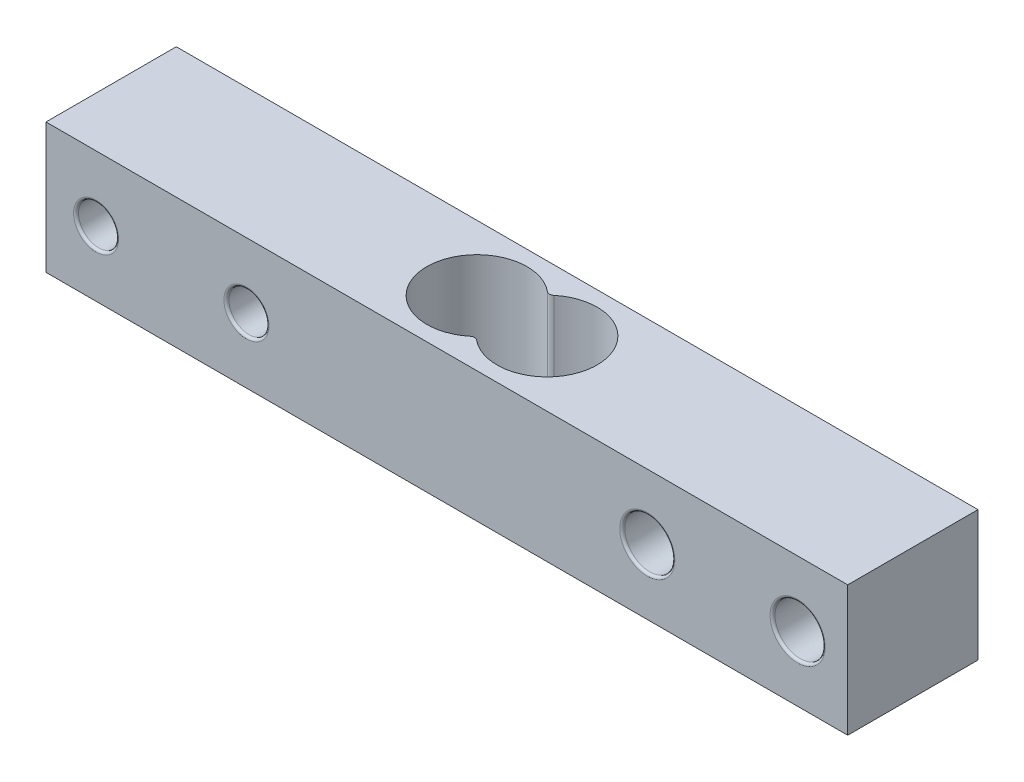
ISO-10303-21;
HEADER;
FILE_DESCRIPTION(('STEP AP214'),'2;1');
FILE_NAME('part.step','',(''),(''),'','','');
FILE_SCHEMA(('AUTOMOTIVE_DESIGN { 1 0 10303 214 1 1 1 1 }'));
ENDSEC;
DATA;
#1=APPLICATION_CONTEXT('core data for automotive mechanical design processes');
#2=APPLICATION_PROTOCOL_DEFINITION('international standard','automotive_design',2000,#1);
#3=PRODUCT_CONTEXT('',#1,'mechanical');
#4=PRODUCT('Part','Part','',(#3));
#5=PRODUCT_RELATED_PRODUCT_CATEGORY('part','',(#4));
#6=PRODUCT_DEFINITION_FORMATION('','',#4);
#7=PRODUCT_DEFINITION_CONTEXT('part definition',#1,'design');
#8=PRODUCT_DEFINITION('design','',#6,#7);
#9=PRODUCT_DEFINITION_SHAPE('','',#8);
#10=(LENGTH_UNIT() NAMED_UNIT(*) SI_UNIT(.MILLI.,.METRE.));
#11=(NAMED_UNIT(*) PLANE_ANGLE_UNIT() SI_UNIT($,.RADIAN.));
#12=(NAMED_UNIT(*) SI_UNIT($,.STERADIAN.) SOLID_ANGLE_UNIT());
#13=UNCERTAINTY_MEASURE_WITH_UNIT(LENGTH_MEASURE(1.E-05),#10,'distance_accuracy_value','');
#14=(GEOMETRIC_REPRESENTATION_CONTEXT(3) GLOBAL_UNCERTAINTY_ASSIGNED_CONTEXT((#13)) GLOBAL_UNIT_ASSIGNED_CONTEXT((#10,
#11,#12)) REPRESENTATION_CONTEXT('',''));
#15=CARTESIAN_POINT('',(0.,0.,0.));
#16=DIRECTION('',(0.,0.,1.));
#17=DIRECTION('',(1.,0.,0.));
#18=AXIS2_PLACEMENT_3D('',#15,#16,#17);
#19=CARTESIAN_POINT('',(12.0209096982276,0.,-7.05386009058646));
#20=DIRECTION('',(0.,1.,0.));
#21=DIRECTION('',(1.,0.,0.));
#22=AXIS2_PLACEMENT_3D('',#19,#20,#21);
#23=PLANE('',#22);
#24=CARTESIAN_POINT('',(12.0209096982276,0.,-11.2965007777057));
#25=DIRECTION('',(0.,1.,0.));
#26=DIRECTION('',(0.,0.,1.));
#27=AXIS2_PLACEMENT_3D('',#24,#25,#26);
#28=CIRCLE('',#27,0.5);
#29=CARTESIAN_POINT('',(11.7027278800458,0.,-10.9108061697858));
#30=VERTEX_POINT('',#29);
#31=CARTESIAN_POINT('',(12.3390915164094,0.,-10.9108061697858));
#32=VERTEX_POINT('',#31);
#33=EDGE_CURVE('E264',#30,#32,#28,.T.);
#34=ORIENTED_EDGE('',*,*,#33,.F.);
#35=CARTESIAN_POINT('',(8.52090969822762,0.,-7.05386009058646));
#36=DIRECTION('',(0.,1.,0.));
#37=DIRECTION('',(-1.,0.,0.));
#38=AXIS2_PLACEMENT_3D('',#35,#36,#37);
#39=CIRCLE('',#38,5.);
#40=CARTESIAN_POINT('',(11.7027278800458,0.,-3.19691401138712));
#41=VERTEX_POINT('',#40);
#42=EDGE_CURVE('E280',#30,#41,#39,.T.);
#43=ORIENTED_EDGE('',*,*,#42,.T.);
#44=CARTESIAN_POINT('',(12.0209096982276,0.,-2.81121940346718));
#45=DIRECTION('',(0.,1.,0.));
#46=DIRECTION('',(0.,0.,-1.));
#47=AXIS2_PLACEMENT_3D('',#44,#45,#46);
#48=CIRCLE('',#47,0.5);
#49=CARTESIAN_POINT('',(12.3390915164094,0.,-3.19691401138712));
#50=VERTEX_POINT('',#49);
#51=EDGE_CURVE('E255',#50,#41,#48,.T.);
#52=ORIENTED_EDGE('',*,*,#51,.F.);
#53=CARTESIAN_POINT('',(15.5209096982276,0.,-7.05386009058646));
#54=DIRECTION('',(0.,1.,0.));
#55=DIRECTION('',(-1.,0.,0.));
#56=AXIS2_PLACEMENT_3D('',#53,#54,#55);
#57=CIRCLE('',#56,5.);
#58=EDGE_CURVE('E155',#50,#32,#57,.T.);
#59=ORIENTED_EDGE('',*,*,#58,.T.);
#60=EDGE_LOOP('',(#34,#43,#52,#59));
#61=FACE_BOUND('',#60,.T.);
#62=DIRECTION('',(-1.,0.,0.));
#63=VECTOR('',#62,1.);
#64=CARTESIAN_POINT('',(52.0209096982276,0.,-0.553860090586464));
#65=LINE('',#64,#63);
#66=CARTESIAN_POINT('',(52.0209096982276,0.,-0.553860090586464));
#67=VERTEX_POINT('',#66);
#68=CARTESIAN_POINT('',(-27.9790903017724,0.,-0.553860090586464));
#69=VERTEX_POINT('',#68);
#70=EDGE_CURVE('E266',#67,#69,#65,.T.);
#71=ORIENTED_EDGE('',*,*,#70,.T.);
#72=DIRECTION('',(0.,0.,-1.));
#73=VECTOR('',#72,1.);
#74=CARTESIAN_POINT('',(-27.9790903017724,0.,-0.553860090586464));
#75=LINE('',#74,#73);
#76=CARTESIAN_POINT('',(-27.9790903017724,0.,-13.5538600905865));
#77=VERTEX_POINT('',#76);
#78=EDGE_CURVE('E27',#69,#77,#75,.T.);
#79=ORIENTED_EDGE('',*,*,#78,.T.);
#80=DIRECTION('',(1.,0.,0.));
#81=VECTOR('',#80,1.);
#82=CARTESIAN_POINT('',(-27.9790903017724,0.,-13.5538600905865));
#83=LINE('',#82,#81);
#84=CARTESIAN_POINT('',(52.0209096982276,0.,-13.5538600905865));
#85=VERTEX_POINT('',#84);
#86=EDGE_CURVE('E259',#77,#85,#83,.T.);
#87=ORIENTED_EDGE('',*,*,#86,.T.);
#88=DIRECTION('',(0.,0.,1.));
#89=VECTOR('',#88,1.);
#90=CARTESIAN_POINT('',(52.0209096982276,0.,-13.5538600905865));
#91=LINE('',#90,#89);
#92=EDGE_CURVE('E10',#85,#67,#91,.T.);
#93=ORIENTED_EDGE('',*,*,#92,.T.);
#94=EDGE_LOOP('',(#71,#79,#87,#93));
#95=FACE_BOUND('',#94,.T.);
#96=ADVANCED_FACE('F16',(#61,#95),#23,.F.);
#97=CARTESIAN_POINT('',(52.0209096982276,0.,-0.553860090586464));
#98=DIRECTION('',(1.,0.,0.));
#99=DIRECTION('',(0.,1.,0.));
#100=AXIS2_PLACEMENT_3D('',#97,#98,#99);
#101=PLANE('',#100);
#102=ORIENTED_EDGE('',*,*,#92,.F.);
#103=DIRECTION('',(0.,1.,0.));
#104=VECTOR('',#103,1.);
#105=CARTESIAN_POINT('',(52.0209096982276,0.,-13.5538600905865));
#106=LINE('',#105,#104);
#107=CARTESIAN_POINT('',(52.0209096982276,13.,-13.5538600905865));
#108=VERTEX_POINT('',#107);
#109=EDGE_CURVE('E297',#85,#108,#106,.T.);
#110=ORIENTED_EDGE('',*,*,#109,.T.);
#111=DIRECTION('',(0.,0.,-1.));
#112=VECTOR('',#111,1.);
#113=CARTESIAN_POINT('',(52.0209096982276,13.,-13.5538600905865));
#114=LINE('',#113,#112);
#115=CARTESIAN_POINT('',(52.0209096982276,13.,-0.553860090586464));
#116=VERTEX_POINT('',#115);
#117=EDGE_CURVE('E279',#116,#108,#114,.T.);
#118=ORIENTED_EDGE('',*,*,#117,.F.);
#119=DIRECTION('',(0.,1.,0.));
#120=VECTOR('',#119,1.);
#121=CARTESIAN_POINT('',(52.0209096982276,0.,-0.553860090586464));
#122=LINE('',#121,#120);
#123=EDGE_CURVE('E250',#67,#116,#122,.T.);
#124=ORIENTED_EDGE('',*,*,#123,.F.);
#125=EDGE_LOOP('',(#102,#110,#118,#124));
#126=FACE_BOUND('',#125,.T.);
#127=ADVANCED_FACE('F363',(#126),#101,.T.);
#128=CARTESIAN_POINT('',(-27.9790903017724,0.,-13.5538600905865));
#129=DIRECTION('',(-1.,0.,0.));
#130=DIRECTION('',(0.,0.,1.));
#131=AXIS2_PLACEMENT_3D('',#128,#129,#130);
#132=PLANE('',#131);
#133=ORIENTED_EDGE('',*,*,#78,.F.);
#134=DIRECTION('',(0.,1.,0.));
#135=VECTOR('',#134,1.);
#136=CARTESIAN_POINT('',(-27.9790903017724,0.,-0.553860090586464));
#137=LINE('',#136,#135);
#138=CARTESIAN_POINT('',(-27.9790903017724,13.,-0.553860090586464));
#139=VERTEX_POINT('',#138);
#140=EDGE_CURVE('E247',#69,#139,#137,.T.);
#141=ORIENTED_EDGE('',*,*,#140,.T.);
#142=DIRECTION('',(0.,0.,1.));
#143=VECTOR('',#142,1.);
#144=CARTESIAN_POINT('',(-27.9790903017724,13.,-0.553860090586464));
#145=LINE('',#144,#143);
#146=CARTESIAN_POINT('',(-27.9790903017724,13.,-13.5538600905865));
#147=VERTEX_POINT('',#146);
#148=EDGE_CURVE('E246',#147,#139,#145,.T.);
#149=ORIENTED_EDGE('',*,*,#148,.F.);
#150=DIRECTION('',(0.,1.,0.));
#151=VECTOR('',#150,1.);
#152=CARTESIAN_POINT('',(-27.9790903017724,0.,-13.5538600905865));
#153=LINE('',#152,#151);
#154=EDGE_CURVE('E295',#77,#147,#153,.T.);
#155=ORIENTED_EDGE('',*,*,#154,.F.);
#156=EDGE_LOOP('',(#133,#141,#149,#155));
#157=FACE_BOUND('',#156,.T.);
#158=ADVANCED_FACE('F451',(#157),#132,.T.);
#159=CARTESIAN_POINT('',(15.5209096982276,13.,-7.05386009058646));
#160=DIRECTION('',(0.,-1.,0.));
#161=DIRECTION('',(1.,0.,0.));
#162=AXIS2_PLACEMENT_3D('',#159,#160,#161);
#163=CYLINDRICAL_SURFACE('',#162,5.);
#164=DIRECTION('',(0.,1.,0.));
#165=VECTOR('',#164,1.);
#166=CARTESIAN_POINT('',(12.3390915164094,13.,-10.9108061697858));
#167=LINE('',#166,#165);
#168=CARTESIAN_POINT('',(12.3390915164094,13.,-10.9108061697858));
#169=VERTEX_POINT('',#168);
#170=EDGE_CURVE('E260',#32,#169,#167,.T.);
#171=ORIENTED_EDGE('',*,*,#170,.F.);
#172=ORIENTED_EDGE('',*,*,#58,.F.);
#173=DIRECTION('',(0.,-1.,0.));
#174=VECTOR('',#173,1.);
#175=CARTESIAN_POINT('',(12.3390915164094,13.,-3.19691401138711));
#176=LINE('',#175,#174);
#177=CARTESIAN_POINT('',(12.3390915164094,13.,-3.19691401138712));
#178=VERTEX_POINT('',#177);
#179=EDGE_CURVE('E251',#178,#50,#176,.T.);
#180=ORIENTED_EDGE('',*,*,#179,.F.);
#181=CARTESIAN_POINT('',(15.5209096982276,13.,-7.05386009058646));
#182=DIRECTION('',(0.,-1.,0.));
#183=DIRECTION('',(-1.,0.,0.));
#184=AXIS2_PLACEMENT_3D('',#181,#182,#183);
#185=CIRCLE('',#184,5.);
#186=EDGE_CURVE('E241',#169,#178,#185,.T.);
#187=ORIENTED_EDGE('',*,*,#186,.F.);
#188=EDGE_LOOP('',(#171,#172,#180,#187));
#189=FACE_BOUND('',#188,.T.);
#190=ADVANCED_FACE('F471',(#189),#163,.F.);
#191=CARTESIAN_POINT('',(47.0209096982276,6.5,-0.803860090586464));
#192=DIRECTION('',(0.,0.,-1.));
#193=DIRECTION('',(-1.,0.,0.));
#194=AXIS2_PLACEMENT_3D('',#191,#192,#193);
#195=TOROIDAL_SURFACE('',#194,2.75,0.25);
#196=CARTESIAN_POINT('',(47.0209096982276,6.5,-0.553860090586464));
#197=DIRECTION('',(0.,0.,1.));
#198=DIRECTION('',(1.,0.,0.));
#199=AXIS2_PLACEMENT_3D('',#196,#197,#198);
#200=CIRCLE('',#199,2.75);
#201=CARTESIAN_POINT('',(49.7709096982276,6.5,-0.553860090586464));
#202=VERTEX_POINT('',#201);
#203=EDGE_CURVE('E274',#202,#202,#200,.T.);
#204=ORIENTED_EDGE('',*,*,#203,.T.);
#205=CARTESIAN_POINT('',(49.7709096982276,6.5,-0.803860090586464));
#206=DIRECTION('',(0.,-1.,0.));
#207=DIRECTION('',(1.,0.,0.));
#208=AXIS2_PLACEMENT_3D('',#205,#206,#207);
#209=CIRCLE('',#208,0.25);
#210=CARTESIAN_POINT('',(49.5209096982276,6.5,-0.803860090586464));
#211=VERTEX_POINT('',#210);
#212=EDGE_CURVE('E320',#202,#211,#209,.T.);
#213=ORIENTED_EDGE('',*,*,#212,.T.);
#214=CARTESIAN_POINT('',(47.0209096982276,6.5,-0.803860090586464));
#215=DIRECTION('',(0.,0.,-1.));
#216=DIRECTION('',(1.,0.,0.));
#217=AXIS2_PLACEMENT_3D('',#214,#215,#216);
#218=CIRCLE('',#217,2.5);
#219=CARTESIAN_POINT('',(44.5209096982276,6.5,-0.803860090586464));
#220=VERTEX_POINT('',#219);
#221=EDGE_CURVE('E237',#211,#220,#218,.T.);
#222=ORIENTED_EDGE('',*,*,#221,.T.);
#223=CARTESIAN_POINT('',(47.0209096982276,6.5,-0.803860090586464));
#224=DIRECTION('',(0.,0.,-1.));
#225=DIRECTION('',(1.,0.,0.));
#226=AXIS2_PLACEMENT_3D('',#223,#224,#225);
#227=CIRCLE('',#226,2.5);
#228=EDGE_CURVE('E303',#220,#211,#227,.T.);
#229=ORIENTED_EDGE('',*,*,#228,.T.);
#230=ORIENTED_EDGE('',*,*,#212,.F.);
#231=EDGE_LOOP('',(#204,#213,#222,#229,#230));
#232=FACE_BOUND('',#231,.T.);
#233=ADVANCED_FACE('F469',(#232),#195,.T.);
#234=CARTESIAN_POINT('',(32.0209096982276,6.5,-0.803860090586464));
#235=DIRECTION('',(0.,0.,-1.));
#236=DIRECTION('',(-1.,0.,0.));
#237=AXIS2_PLACEMENT_3D('',#234,#235,#236);
#238=TOROIDAL_SURFACE('',#237,2.75,0.25);
#239=CARTESIAN_POINT('',(32.0209096982276,6.5,-0.553860090586464));
#240=DIRECTION('',(0.,0.,1.));
#241=DIRECTION('',(1.,0.,0.));
#242=AXIS2_PLACEMENT_3D('',#239,#240,#241);
#243=CIRCLE('',#242,2.75);
#244=CARTESIAN_POINT('',(34.7709096982276,6.5,-0.553860090586464));
#245=VERTEX_POINT('',#244);
#246=EDGE_CURVE('E205',#245,#245,#243,.T.);
#247=ORIENTED_EDGE('',*,*,#246,.T.);
#248=CARTESIAN_POINT('',(34.7709096982276,6.5,-0.803860090586464));
#249=DIRECTION('',(0.,-1.,0.));
#250=DIRECTION('',(1.,0.,0.));
#251=AXIS2_PLACEMENT_3D('',#248,#249,#250);
#252=CIRCLE('',#251,0.25);
#253=CARTESIAN_POINT('',(34.5209096982276,6.5,-0.803860090586464));
#254=VERTEX_POINT('',#253);
#255=EDGE_CURVE('E40',#245,#254,#252,.T.);
#256=ORIENTED_EDGE('',*,*,#255,.T.);
#257=CARTESIAN_POINT('',(32.0209096982276,6.5,-0.803860090586464));
#258=DIRECTION('',(0.,0.,-1.));
#259=DIRECTION('',(1.,0.,0.));
#260=AXIS2_PLACEMENT_3D('',#257,#258,#259);
#261=CIRCLE('',#260,2.5);
#262=CARTESIAN_POINT('',(29.5209096982276,6.5,-0.803860090586464));
#263=VERTEX_POINT('',#262);
#264=EDGE_CURVE('E345',#254,#263,#261,.T.);
#265=ORIENTED_EDGE('',*,*,#264,.T.);
#266=CARTESIAN_POINT('',(32.0209096982276,6.5,-0.803860090586464));
#267=DIRECTION('',(0.,0.,-1.));
#268=DIRECTION('',(1.,0.,0.));
#269=AXIS2_PLACEMENT_3D('',#266,#267,#268);
#270=CIRCLE('',#269,2.5);
#271=EDGE_CURVE('E311',#263,#254,#270,.T.);
#272=ORIENTED_EDGE('',*,*,#271,.T.);
#273=ORIENTED_EDGE('',*,*,#255,.F.);
#274=EDGE_LOOP('',(#247,#256,#265,#272,#273));
#275=FACE_BOUND('',#274,.T.);
#276=ADVANCED_FACE('F397',(#275),#238,.T.);
#277=CARTESIAN_POINT('',(-7.97909030177238,6.5,-0.803860090586464));
#278=DIRECTION('',(0.,0.,-1.));
#279=DIRECTION('',(-1.,0.,0.));
#280=AXIS2_PLACEMENT_3D('',#277,#278,#279);
#281=TOROIDAL_SURFACE('',#280,2.25,0.25);
#282=CARTESIAN_POINT('',(-7.97909030177238,6.5,-0.553860090586464));
#283=DIRECTION('',(0.,0.,1.));
#284=DIRECTION('',(1.,0.,0.));
#285=AXIS2_PLACEMENT_3D('',#282,#283,#284);
#286=CIRCLE('',#285,2.25);
#287=CARTESIAN_POINT('',(-5.72909030177238,6.5,-0.553860090586464));
#288=VERTEX_POINT('',#287);
#289=EDGE_CURVE('E203',#288,#288,#286,.T.);
#290=ORIENTED_EDGE('',*,*,#289,.T.);
#291=CARTESIAN_POINT('',(-5.72909030177238,6.5,-0.803860090586464));
#292=DIRECTION('',(0.,-1.,0.));
#293=DIRECTION('',(1.,0.,0.));
#294=AXIS2_PLACEMENT_3D('',#291,#292,#293);
#295=CIRCLE('',#294,0.25);
#296=CARTESIAN_POINT('',(-5.97909030177238,6.5,-0.803860090586464));
#297=VERTEX_POINT('',#296);
#298=EDGE_CURVE('E196',#288,#297,#295,.T.);
#299=ORIENTED_EDGE('',*,*,#298,.T.);
#300=CARTESIAN_POINT('',(-7.97909030177238,6.5,-0.803860090586464));
#301=DIRECTION('',(0.,0.,-1.));
#302=DIRECTION('',(1.,0.,0.));
#303=AXIS2_PLACEMENT_3D('',#300,#301,#302);
#304=CIRCLE('',#303,2.);
#305=CARTESIAN_POINT('',(-9.97909030177238,6.5,-0.803860090586464));
#306=VERTEX_POINT('',#305);
#307=EDGE_CURVE('E200',#297,#306,#304,.T.);
#308=ORIENTED_EDGE('',*,*,#307,.T.);
#309=CARTESIAN_POINT('',(-7.97909030177238,6.5,-0.803860090586464));
#310=DIRECTION('',(0.,0.,-1.));
#311=DIRECTION('',(1.,0.,0.));
#312=AXIS2_PLACEMENT_3D('',#309,#310,#311);
#313=CIRCLE('',#312,2.);
#314=EDGE_CURVE('E210',#306,#297,#313,.T.);
#315=ORIENTED_EDGE('',*,*,#314,.T.);
#316=ORIENTED_EDGE('',*,*,#298,.F.);
#317=EDGE_LOOP('',(#290,#299,#308,#315,#316));
#318=FACE_BOUND('',#317,.T.);
#319=ADVANCED_FACE('F198',(#318),#281,.T.);
#320=CARTESIAN_POINT('',(-27.9790903017724,0.,-0.553860090586464));
#321=DIRECTION('',(0.,0.,1.));
#322=DIRECTION('',(1.,0.,0.));
#323=AXIS2_PLACEMENT_3D('',#320,#321,#322);
#324=PLANE('',#323);
#325=CARTESIAN_POINT('',(-22.9790903017724,6.5,-0.553860090586464));
#326=DIRECTION('',(0.,0.,1.));
#327=DIRECTION('',(1.,0.,0.));
#328=AXIS2_PLACEMENT_3D('',#325,#326,#327);
#329=CIRCLE('',#328,2.25);
#330=CARTESIAN_POINT('',(-20.7290903017724,6.5,-0.553860090586464));
#331=VERTEX_POINT('',#330);
#332=EDGE_CURVE('E288',#331,#331,#329,.T.);
#333=ORIENTED_EDGE('',*,*,#332,.F.);
#334=EDGE_LOOP('',(#333));
#335=FACE_BOUND('',#334,.T.);
#336=ORIENTED_EDGE('',*,*,#246,.F.);
#337=EDGE_LOOP('',(#336));
#338=FACE_BOUND('',#337,.T.);
#339=ORIENTED_EDGE('',*,*,#203,.F.);
#340=EDGE_LOOP('',(#339));
#341=FACE_BOUND('',#340,.T.);
#342=ORIENTED_EDGE('',*,*,#289,.F.);
#343=EDGE_LOOP('',(#342));
#344=FACE_BOUND('',#343,.T.);
#345=ORIENTED_EDGE('',*,*,#70,.F.);
#346=ORIENTED_EDGE('',*,*,#123,.T.);
#347=DIRECTION('',(1.,0.,0.));
#348=VECTOR('',#347,1.);
#349=CARTESIAN_POINT('',(52.0209096982276,13.,-0.553860090586464));
#350=LINE('',#349,#348);
#351=EDGE_CURVE('E275',#139,#116,#350,.T.);
#352=ORIENTED_EDGE('',*,*,#351,.F.);
#353=ORIENTED_EDGE('',*,*,#140,.F.);
#354=EDGE_LOOP('',(#345,#346,#352,#353));
#355=FACE_BOUND('',#354,.T.);
#356=ADVANCED_FACE('F18',(#335,#338,#341,#344,#355),#324,.T.);
#357=CARTESIAN_POINT('',(-22.9790903017724,6.5,-0.803860090586464));
#358=DIRECTION('',(0.,0.,-1.));
#359=DIRECTION('',(-1.,0.,0.));
#360=AXIS2_PLACEMENT_3D('',#357,#358,#359);
#361=TOROIDAL_SURFACE('',#360,2.25,0.25);
#362=ORIENTED_EDGE('',*,*,#332,.T.);
#363=CARTESIAN_POINT('',(-20.7290903017724,6.5,-0.803860090586464));
#364=DIRECTION('',(0.,-1.,0.));
#365=DIRECTION('',(1.,0.,0.));
#366=AXIS2_PLACEMENT_3D('',#363,#364,#365);
#367=CIRCLE('',#366,0.25);
#368=CARTESIAN_POINT('',(-20.9790903017724,6.5,-0.803860090586464));
#369=VERTEX_POINT('',#368);
#370=EDGE_CURVE('E269',#331,#369,#367,.T.);
#371=ORIENTED_EDGE('',*,*,#370,.T.);
#372=CARTESIAN_POINT('',(-22.9790903017724,6.5,-0.803860090586464));
#373=DIRECTION('',(0.,0.,-1.));
#374=DIRECTION('',(1.,0.,0.));
#375=AXIS2_PLACEMENT_3D('',#372,#373,#374);
#376=CIRCLE('',#375,2.);
#377=CARTESIAN_POINT('',(-24.9790903017724,6.5,-0.803860090586464));
#378=VERTEX_POINT('',#377);
#379=EDGE_CURVE('E234',#369,#378,#376,.T.);
#380=ORIENTED_EDGE('',*,*,#379,.T.);
#381=CARTESIAN_POINT('',(-22.9790903017724,6.5,-0.803860090586464));
#382=DIRECTION('',(0.,0.,-1.));
#383=DIRECTION('',(1.,0.,0.));
#384=AXIS2_PLACEMENT_3D('',#381,#382,#383);
#385=CIRCLE('',#384,2.);
#386=EDGE_CURVE('E235',#378,#369,#385,.T.);
#387=ORIENTED_EDGE('',*,*,#386,.T.);
#388=ORIENTED_EDGE('',*,*,#370,.F.);
#389=EDGE_LOOP('',(#362,#371,#380,#387,#388));
#390=FACE_BOUND('',#389,.T.);
#391=ADVANCED_FACE('F433',(#390),#361,.T.);
#392=CARTESIAN_POINT('',(-22.9790903017724,6.5,-0.553860090586464));
#393=DIRECTION('',(0.,0.,-1.));
#394=DIRECTION('',(1.,0.,0.));
#395=AXIS2_PLACEMENT_3D('',#392,#393,#394);
#396=CYLINDRICAL_SURFACE('',#395,2.);
#397=ORIENTED_EDGE('',*,*,#386,.F.);
#398=DIRECTION('',(0.,0.,-1.));
#399=VECTOR('',#398,1.);
#400=CARTESIAN_POINT('',(-24.9790903017724,6.5,-0.553860090586464));
#401=LINE('',#400,#399);
#402=CARTESIAN_POINT('',(-24.9790903017724,6.5,-13.3038600905865));
#403=VERTEX_POINT('',#402);
#404=EDGE_CURVE('E232',#378,#403,#401,.T.);
#405=ORIENTED_EDGE('',*,*,#404,.T.);
#406=CARTESIAN_POINT('',(-22.9790903017724,6.5,-13.3038600905865));
#407=DIRECTION('',(0.,0.,1.));
#408=DIRECTION('',(1.,0.,0.));
#409=AXIS2_PLACEMENT_3D('',#406,#407,#408);
#410=CIRCLE('',#409,2.);
#411=EDGE_CURVE('E230',#403,#403,#410,.T.);
#412=ORIENTED_EDGE('',*,*,#411,.F.);
#413=ORIENTED_EDGE('',*,*,#404,.F.);
#414=ORIENTED_EDGE('',*,*,#379,.F.);
#415=EDGE_LOOP('',(#397,#405,#412,#413,#414));
#416=FACE_BOUND('',#415,.T.);
#417=ADVANCED_FACE('F430',(#416),#396,.F.);
#418=CARTESIAN_POINT('',(-22.9790903017724,6.5,-13.3038600905865));
#419=DIRECTION('',(0.,0.,1.));
#420=DIRECTION('',(1.,0.,0.));
#421=AXIS2_PLACEMENT_3D('',#418,#419,#420);
#422=TOROIDAL_SURFACE('',#421,2.25,0.25);
#423=CARTESIAN_POINT('',(-22.9790903017724,6.5,-13.5538600905865));
#424=DIRECTION('',(0.,0.,-1.));
#425=DIRECTION('',(1.,0.,0.));
#426=AXIS2_PLACEMENT_3D('',#423,#424,#425);
#427=CIRCLE('',#426,2.25);
#428=CARTESIAN_POINT('',(-25.2290903017724,6.5,-13.5538600905865));
#429=VERTEX_POINT('',#428);
#430=EDGE_CURVE('E304',#429,#429,#427,.T.);
#431=ORIENTED_EDGE('',*,*,#430,.T.);
#432=CARTESIAN_POINT('',(-25.2290903017724,6.5,-13.3038600905865));
#433=DIRECTION('',(0.,-1.,0.));
#434=DIRECTION('',(-1.,0.,0.));
#435=AXIS2_PLACEMENT_3D('',#432,#433,#434);
#436=CIRCLE('',#435,0.25);
#437=EDGE_CURVE('E214',#429,#403,#436,.T.);
#438=ORIENTED_EDGE('',*,*,#437,.T.);
#439=ORIENTED_EDGE('',*,*,#411,.T.);
#440=ORIENTED_EDGE('',*,*,#437,.F.);
#441=EDGE_LOOP('',(#431,#438,#439,#440));
#442=FACE_BOUND('',#441,.T.);
#443=ADVANCED_FACE('F426',(#442),#422,.T.);
#444=CARTESIAN_POINT('',(-7.97909030177238,6.5,-0.553860090586464));
#445=DIRECTION('',(0.,0.,-1.));
#446=DIRECTION('',(1.,0.,0.));
#447=AXIS2_PLACEMENT_3D('',#444,#445,#446);
#448=CYLINDRICAL_SURFACE('',#447,2.);
#449=ORIENTED_EDGE('',*,*,#314,.F.);
#450=DIRECTION('',(0.,0.,-1.));
#451=VECTOR('',#450,1.);
#452=CARTESIAN_POINT('',(-9.97909030177238,6.5,-0.553860090586464));
#453=LINE('',#452,#451);
#454=CARTESIAN_POINT('',(-9.97909030177238,6.5,-13.3038600905865));
#455=VERTEX_POINT('',#454);
#456=EDGE_CURVE('E212',#306,#455,#453,.T.);
#457=ORIENTED_EDGE('',*,*,#456,.T.);
#458=CARTESIAN_POINT('',(-7.97909030177238,6.5,-13.3038600905865));
#459=DIRECTION('',(0.,0.,1.));
#460=DIRECTION('',(1.,0.,0.));
#461=AXIS2_PLACEMENT_3D('',#458,#459,#460);
#462=CIRCLE('',#461,2.);
#463=EDGE_CURVE('E217',#455,#455,#462,.T.);
#464=ORIENTED_EDGE('',*,*,#463,.F.);
#465=ORIENTED_EDGE('',*,*,#456,.F.);
#466=ORIENTED_EDGE('',*,*,#307,.F.);
#467=EDGE_LOOP('',(#449,#457,#464,#465,#466));
#468=FACE_BOUND('',#467,.T.);
#469=ADVANCED_FACE('F209',(#468),#448,.F.);
#470=CARTESIAN_POINT('',(-7.97909030177238,6.5,-13.3038600905865));
#471=DIRECTION('',(0.,0.,1.));
#472=DIRECTION('',(1.,0.,0.));
#473=AXIS2_PLACEMENT_3D('',#470,#471,#472);
#474=TOROIDAL_SURFACE('',#473,2.25,0.25);
#475=CARTESIAN_POINT('',(-7.97909030177238,6.5,-13.5538600905865));
#476=DIRECTION('',(0.,0.,-1.));
#477=DIRECTION('',(1.,0.,0.));
#478=AXIS2_PLACEMENT_3D('',#475,#476,#477);
#479=CIRCLE('',#478,2.25);
#480=CARTESIAN_POINT('',(-10.2290903017724,6.5,-13.5538600905865));
#481=VERTEX_POINT('',#480);
#482=EDGE_CURVE('E299',#481,#481,#479,.T.);
#483=ORIENTED_EDGE('',*,*,#482,.T.);
#484=CARTESIAN_POINT('',(-10.2290903017724,6.5,-13.3038600905865));
#485=DIRECTION('',(0.,-1.,0.));
#486=DIRECTION('',(-1.,0.,0.));
#487=AXIS2_PLACEMENT_3D('',#484,#485,#486);
#488=CIRCLE('',#487,0.25);
#489=EDGE_CURVE('E226',#481,#455,#488,.T.);
#490=ORIENTED_EDGE('',*,*,#489,.T.);
#491=ORIENTED_EDGE('',*,*,#463,.T.);
#492=ORIENTED_EDGE('',*,*,#489,.F.);
#493=EDGE_LOOP('',(#483,#490,#491,#492));
#494=FACE_BOUND('',#493,.T.);
#495=ADVANCED_FACE('F476',(#494),#474,.T.);
#496=CARTESIAN_POINT('',(32.0209096982276,6.5,-0.553860090586464));
#497=DIRECTION('',(0.,0.,-1.));
#498=DIRECTION('',(1.,0.,0.));
#499=AXIS2_PLACEMENT_3D('',#496,#497,#498);
#500=CYLINDRICAL_SURFACE('',#499,2.5);
#501=ORIENTED_EDGE('',*,*,#271,.F.);
#502=DIRECTION('',(0.,0.,-1.));
#503=VECTOR('',#502,1.);
#504=CARTESIAN_POINT('',(29.5209096982276,6.5,-0.553860090586464));
#505=LINE('',#504,#503);
#506=CARTESIAN_POINT('',(29.5209096982276,6.5,-13.3038600905865));
#507=VERTEX_POINT('',#506);
#508=EDGE_CURVE('E386',#263,#507,#505,.T.);
#509=ORIENTED_EDGE('',*,*,#508,.T.);
#510=CARTESIAN_POINT('',(32.0209096982276,6.5,-13.3038600905865));
#511=DIRECTION('',(0.,0.,1.));
#512=DIRECTION('',(1.,0.,0.));
#513=AXIS2_PLACEMENT_3D('',#510,#511,#512);
#514=CIRCLE('',#513,2.5);
#515=EDGE_CURVE('E307',#507,#507,#514,.T.);
#516=ORIENTED_EDGE('',*,*,#515,.F.);
#517=ORIENTED_EDGE('',*,*,#508,.F.);
#518=ORIENTED_EDGE('',*,*,#264,.F.);
#519=EDGE_LOOP('',(#501,#509,#516,#517,#518));
#520=FACE_BOUND('',#519,.T.);
#521=ADVANCED_FACE('F401',(#520),#500,.F.);
#522=CARTESIAN_POINT('',(32.0209096982276,6.5,-13.3038600905865));
#523=DIRECTION('',(0.,0.,1.));
#524=DIRECTION('',(1.,0.,0.));
#525=AXIS2_PLACEMENT_3D('',#522,#523,#524);
#526=TOROIDAL_SURFACE('',#525,2.75,0.25);
#527=CARTESIAN_POINT('',(32.0209096982276,6.5,-13.5538600905865));
#528=DIRECTION('',(0.,0.,-1.));
#529=DIRECTION('',(1.,0.,0.));
#530=AXIS2_PLACEMENT_3D('',#527,#528,#529);
#531=CIRCLE('',#530,2.75);
#532=CARTESIAN_POINT('',(29.2709096982276,6.5,-13.5538600905865));
#533=VERTEX_POINT('',#532);
#534=EDGE_CURVE('E324',#533,#533,#531,.T.);
#535=ORIENTED_EDGE('',*,*,#534,.T.);
#536=CARTESIAN_POINT('',(29.2709096982276,6.5,-13.3038600905865));
#537=DIRECTION('',(0.,-1.,0.));
#538=DIRECTION('',(-1.,0.,0.));
#539=AXIS2_PLACEMENT_3D('',#536,#537,#538);
#540=CIRCLE('',#539,0.25);
#541=EDGE_CURVE('E20',#533,#507,#540,.T.);
#542=ORIENTED_EDGE('',*,*,#541,.T.);
#543=ORIENTED_EDGE('',*,*,#515,.T.);
#544=ORIENTED_EDGE('',*,*,#541,.F.);
#545=EDGE_LOOP('',(#535,#542,#543,#544));
#546=FACE_BOUND('',#545,.T.);
#547=ADVANCED_FACE('F457',(#546),#526,.T.);
#548=CARTESIAN_POINT('',(47.0209096982276,6.5,-0.553860090586464));
#549=DIRECTION('',(0.,0.,-1.));
#550=DIRECTION('',(1.,0.,0.));
#551=AXIS2_PLACEMENT_3D('',#548,#549,#550);
#552=CYLINDRICAL_SURFACE('',#551,2.5);
#553=ORIENTED_EDGE('',*,*,#228,.F.);
#554=DIRECTION('',(0.,0.,-1.));
#555=VECTOR('',#554,1.);
#556=CARTESIAN_POINT('',(44.5209096982276,6.5,-0.553860090586464));
#557=LINE('',#556,#555);
#558=CARTESIAN_POINT('',(44.5209096982276,6.5,-13.3038600905865));
#559=VERTEX_POINT('',#558);
#560=EDGE_CURVE('E240',#220,#559,#557,.T.);
#561=ORIENTED_EDGE('',*,*,#560,.T.);
#562=CARTESIAN_POINT('',(47.0209096982276,6.5,-13.3038600905865));
#563=DIRECTION('',(0.,0.,1.));
#564=DIRECTION('',(1.,0.,0.));
#565=AXIS2_PLACEMENT_3D('',#562,#563,#564);
#566=CIRCLE('',#565,2.5);
#567=EDGE_CURVE('E256',#559,#559,#566,.T.);
#568=ORIENTED_EDGE('',*,*,#567,.F.);
#569=ORIENTED_EDGE('',*,*,#560,.F.);
#570=ORIENTED_EDGE('',*,*,#221,.F.);
#571=EDGE_LOOP('',(#553,#561,#568,#569,#570));
#572=FACE_BOUND('',#571,.T.);
#573=ADVANCED_FACE('F460',(#572),#552,.F.);
#574=CARTESIAN_POINT('',(52.0209096982276,0.,-13.5538600905865));
#575=DIRECTION('',(0.,0.,-1.));
#576=DIRECTION('',(0.,-1.,0.));
#577=AXIS2_PLACEMENT_3D('',#574,#575,#576);
#578=PLANE('',#577);
#579=CARTESIAN_POINT('',(47.0209096982276,6.5,-13.5538600905865));
#580=DIRECTION('',(0.,0.,-1.));
#581=DIRECTION('',(1.,0.,0.));
#582=AXIS2_PLACEMENT_3D('',#579,#580,#581);
#583=CIRCLE('',#582,2.75);
#584=CARTESIAN_POINT('',(44.2709096982276,6.5,-13.5538600905865));
#585=VERTEX_POINT('',#584);
#586=EDGE_CURVE('E254',#585,#585,#583,.T.);
#587=ORIENTED_EDGE('',*,*,#586,.F.);
#588=EDGE_LOOP('',(#587));
#589=FACE_BOUND('',#588,.T.);
#590=ORIENTED_EDGE('',*,*,#482,.F.);
#591=EDGE_LOOP('',(#590));
#592=FACE_BOUND('',#591,.T.);
#593=ORIENTED_EDGE('',*,*,#430,.F.);
#594=EDGE_LOOP('',(#593));
#595=FACE_BOUND('',#594,.T.);
#596=ORIENTED_EDGE('',*,*,#534,.F.);
#597=EDGE_LOOP('',(#596));
#598=FACE_BOUND('',#597,.T.);
#599=ORIENTED_EDGE('',*,*,#86,.F.);
#600=ORIENTED_EDGE('',*,*,#154,.T.);
#601=DIRECTION('',(-1.,0.,0.));
#602=VECTOR('',#601,1.);
#603=CARTESIAN_POINT('',(-27.9790903017724,13.,-13.5538600905865));
#604=LINE('',#603,#602);
#605=EDGE_CURVE('E294',#108,#147,#604,.T.);
#606=ORIENTED_EDGE('',*,*,#605,.F.);
#607=ORIENTED_EDGE('',*,*,#109,.F.);
#608=EDGE_LOOP('',(#599,#600,#606,#607));
#609=FACE_BOUND('',#608,.T.);
#610=ADVANCED_FACE('F367',(#589,#592,#595,#598,#609),#578,.T.);
#611=CARTESIAN_POINT('',(47.0209096982276,6.5,-13.3038600905865));
#612=DIRECTION('',(0.,0.,1.));
#613=DIRECTION('',(1.,0.,0.));
#614=AXIS2_PLACEMENT_3D('',#611,#612,#613);
#615=TOROIDAL_SURFACE('',#614,2.75,0.25);
#616=ORIENTED_EDGE('',*,*,#586,.T.);
#617=CARTESIAN_POINT('',(44.2709096982276,6.5,-13.3038600905865));
#618=DIRECTION('',(0.,-1.,0.));
#619=DIRECTION('',(-1.,0.,0.));
#620=AXIS2_PLACEMENT_3D('',#617,#618,#619);
#621=CIRCLE('',#620,0.25);
#622=EDGE_CURVE('E165',#585,#559,#621,.T.);
#623=ORIENTED_EDGE('',*,*,#622,.T.);
#624=ORIENTED_EDGE('',*,*,#567,.T.);
#625=ORIENTED_EDGE('',*,*,#622,.F.);
#626=EDGE_LOOP('',(#616,#623,#624,#625));
#627=FACE_BOUND('',#626,.T.);
#628=ADVANCED_FACE('F485',(#627),#615,.T.);
#629=CARTESIAN_POINT('',(12.0209096982276,13.,-2.81121940346718));
#630=DIRECTION('',(0.,-1.,0.));
#631=DIRECTION('',(0.,0.,-1.));
#632=AXIS2_PLACEMENT_3D('',#629,#630,#631);
#633=CYLINDRICAL_SURFACE('',#632,0.5);
#634=ORIENTED_EDGE('',*,*,#51,.T.);
#635=DIRECTION('',(0.,1.,0.));
#636=VECTOR('',#635,1.);
#637=CARTESIAN_POINT('',(11.7027278800458,13.,-3.19691401138711));
#638=LINE('',#637,#636);
#639=CARTESIAN_POINT('',(11.7027278800458,13.,-3.19691401138712));
#640=VERTEX_POINT('',#639);
#641=EDGE_CURVE('E284',#41,#640,#638,.T.);
#642=ORIENTED_EDGE('',*,*,#641,.T.);
#643=CARTESIAN_POINT('',(12.0209096982276,13.,-2.81121940346718));
#644=DIRECTION('',(0.,-1.,0.));
#645=DIRECTION('',(0.,0.,-1.));
#646=AXIS2_PLACEMENT_3D('',#643,#644,#645);
#647=CIRCLE('',#646,0.5);
#648=EDGE_CURVE('E245',#640,#178,#647,.T.);
#649=ORIENTED_EDGE('',*,*,#648,.T.);
#650=ORIENTED_EDGE('',*,*,#179,.T.);
#651=EDGE_LOOP('',(#634,#642,#649,#650));
#652=FACE_BOUND('',#651,.T.);
#653=ADVANCED_FACE('F465',(#652),#633,.T.);
#654=CARTESIAN_POINT('',(12.0209096982276,13.,-7.05386009058646));
#655=DIRECTION('',(0.,1.,0.));
#656=DIRECTION('',(1.,0.,0.));
#657=AXIS2_PLACEMENT_3D('',#654,#655,#656);
#658=PLANE('',#657);
#659=CARTESIAN_POINT('',(12.0209096982276,13.,-11.2965007777057));
#660=DIRECTION('',(0.,-1.,0.));
#661=DIRECTION('',(0.,0.,1.));
#662=AXIS2_PLACEMENT_3D('',#659,#660,#661);
#663=CIRCLE('',#662,0.5);
#664=CARTESIAN_POINT('',(11.7027278800458,13.,-10.9108061697858));
#665=VERTEX_POINT('',#664);
#666=EDGE_CURVE('E263',#169,#665,#663,.T.);
#667=ORIENTED_EDGE('',*,*,#666,.F.);
#668=ORIENTED_EDGE('',*,*,#186,.T.);
#669=ORIENTED_EDGE('',*,*,#648,.F.);
#670=CARTESIAN_POINT('',(8.52090969822762,13.,-7.05386009058646));
#671=DIRECTION('',(0.,-1.,0.));
#672=DIRECTION('',(-1.,0.,0.));
#673=AXIS2_PLACEMENT_3D('',#670,#671,#672);
#674=CIRCLE('',#673,5.);
#675=EDGE_CURVE('E281',#640,#665,#674,.T.);
#676=ORIENTED_EDGE('',*,*,#675,.T.);
#677=EDGE_LOOP('',(#667,#668,#669,#676));
#678=FACE_BOUND('',#677,.T.);
#679=ORIENTED_EDGE('',*,*,#351,.T.);
#680=ORIENTED_EDGE('',*,*,#117,.T.);
#681=ORIENTED_EDGE('',*,*,#605,.T.);
#682=ORIENTED_EDGE('',*,*,#148,.T.);
#683=EDGE_LOOP('',(#679,#680,#681,#682));
#684=FACE_BOUND('',#683,.T.);
#685=ADVANCED_FACE('F370',(#678,#684),#658,.T.);
#686=CARTESIAN_POINT('',(8.52090969822762,13.,-7.05386009058646));
#687=DIRECTION('',(0.,-1.,0.));
#688=DIRECTION('',(-1.,0.,0.));
#689=AXIS2_PLACEMENT_3D('',#686,#687,#688);
#690=CYLINDRICAL_SURFACE('',#689,5.);
#691=DIRECTION('',(0.,-1.,0.));
#692=VECTOR('',#691,1.);
#693=CARTESIAN_POINT('',(11.7027278800458,13.,-10.9108061697858));
#694=LINE('',#693,#692);
#695=EDGE_CURVE('E285',#665,#30,#694,.T.);
#696=ORIENTED_EDGE('',*,*,#695,.F.);
#697=ORIENTED_EDGE('',*,*,#675,.F.);
#698=ORIENTED_EDGE('',*,*,#641,.F.);
#699=ORIENTED_EDGE('',*,*,#42,.F.);
#700=EDGE_LOOP('',(#696,#697,#698,#699));
#701=FACE_BOUND('',#700,.T.);
#702=ADVANCED_FACE('F464',(#701),#690,.F.);
#703=CARTESIAN_POINT('',(12.0209096982276,13.,-11.2965007777057));
#704=DIRECTION('',(0.,-1.,0.));
#705=DIRECTION('',(0.,0.,1.));
#706=AXIS2_PLACEMENT_3D('',#703,#704,#705);
#707=CYLINDRICAL_SURFACE('',#706,0.5);
#708=ORIENTED_EDGE('',*,*,#33,.T.);
#709=ORIENTED_EDGE('',*,*,#170,.T.);
#710=ORIENTED_EDGE('',*,*,#666,.T.);
#711=ORIENTED_EDGE('',*,*,#695,.T.);
#712=EDGE_LOOP('',(#708,#709,#710,#711));
#713=FACE_BOUND('',#712,.T.);
#714=ADVANCED_FACE('F455',(#713),#707,.T.);
#715=CLOSED_SHELL('',(#96,#127,#158,#190,#233,#276,#319,#356,#391,#417,#443,#469,#495,#521,#547,
#573,#610,#628,#653,#685,#702,#714));
#716=MANIFOLD_SOLID_BREP('B1',#715);
#717=ADVANCED_BREP_SHAPE_REPRESENTATION('',(#18,#716),#14);
#718=SHAPE_DEFINITION_REPRESENTATION(#9,#717);
ENDSEC;
END-ISO-10303-21;
